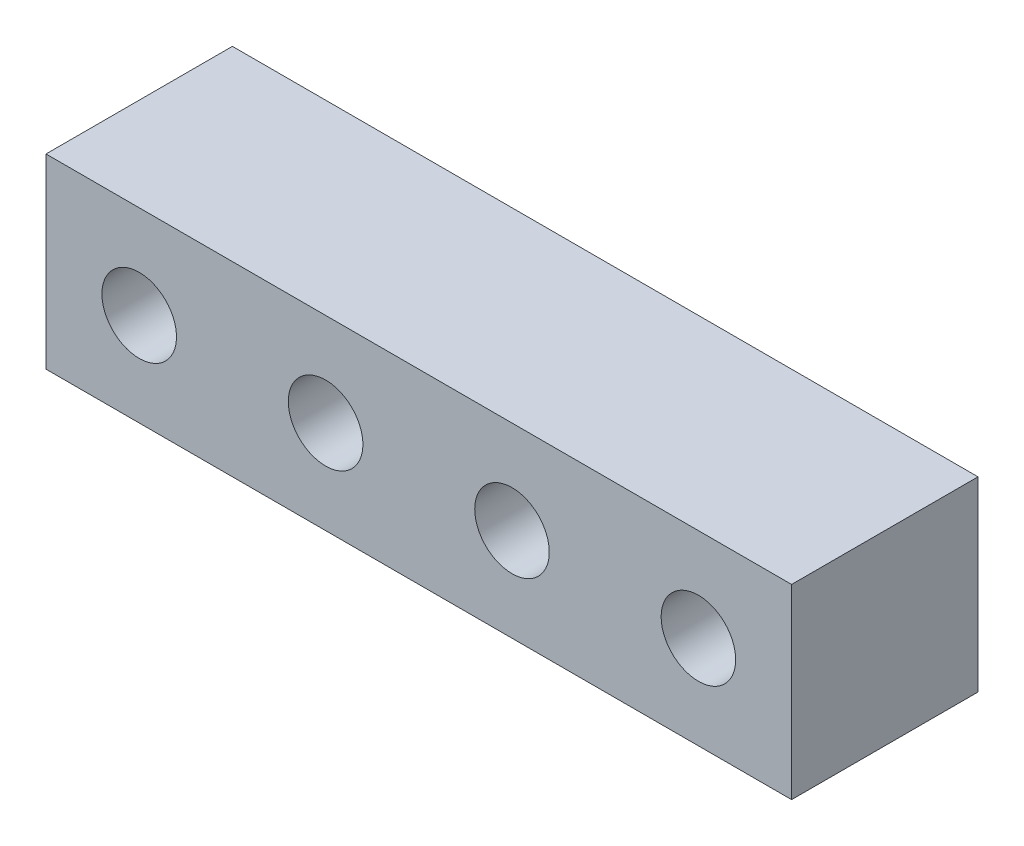
ISO-10303-21;
HEADER;
FILE_DESCRIPTION(('STEP AP214'),'2;1');
FILE_NAME('part.step','',(''),(''),'','','');
FILE_SCHEMA(('AUTOMOTIVE_DESIGN { 1 0 10303 214 1 1 1 1 }'));
ENDSEC;
DATA;
#1=APPLICATION_CONTEXT('core data for automotive mechanical design processes');
#2=APPLICATION_PROTOCOL_DEFINITION('international standard','automotive_design',2000,#1);
#3=PRODUCT_CONTEXT('',#1,'mechanical');
#4=PRODUCT('Part','Part','',(#3));
#5=PRODUCT_RELATED_PRODUCT_CATEGORY('part','',(#4));
#6=PRODUCT_DEFINITION_FORMATION('','',#4);
#7=PRODUCT_DEFINITION_CONTEXT('part definition',#1,'design');
#8=PRODUCT_DEFINITION('design','',#6,#7);
#9=PRODUCT_DEFINITION_SHAPE('','',#8);
#10=(LENGTH_UNIT() NAMED_UNIT(*) SI_UNIT(.MILLI.,.METRE.));
#11=(NAMED_UNIT(*) PLANE_ANGLE_UNIT() SI_UNIT($,.RADIAN.));
#12=(NAMED_UNIT(*) SI_UNIT($,.STERADIAN.) SOLID_ANGLE_UNIT());
#13=UNCERTAINTY_MEASURE_WITH_UNIT(LENGTH_MEASURE(1.E-05),#10,'distance_accuracy_value','');
#14=(GEOMETRIC_REPRESENTATION_CONTEXT(3) GLOBAL_UNCERTAINTY_ASSIGNED_CONTEXT((#13)) GLOBAL_UNIT_ASSIGNED_CONTEXT((#10,
#11,#12)) REPRESENTATION_CONTEXT('',''));
#15=CARTESIAN_POINT('',(0.,0.,0.));
#16=DIRECTION('',(0.,0.,1.));
#17=DIRECTION('',(1.,0.,0.));
#18=AXIS2_PLACEMENT_3D('',#15,#16,#17);
#19=CARTESIAN_POINT('',(-3.81,12.25,0.));
#20=DIRECTION('',(0.,0.,-1.));
#21=DIRECTION('',(1.,0.,0.));
#22=AXIS2_PLACEMENT_3D('',#19,#20,#21);
#23=CYLINDRICAL_SURFACE('',#22,0.508);
#24=CARTESIAN_POINT('',(-3.81,12.25,-2.54));
#25=DIRECTION('',(0.,0.,1.));
#26=DIRECTION('',(1.,0.,0.));
#27=AXIS2_PLACEMENT_3D('',#24,#25,#26);
#28=CIRCLE('',#27,0.508);
#29=CARTESIAN_POINT('',(-4.318,12.25,-2.54));
#30=VERTEX_POINT('',#29);
#31=EDGE_CURVE('E39',#30,#30,#28,.T.);
#32=ORIENTED_EDGE('',*,*,#31,.F.);
#33=EDGE_LOOP('',(#32));
#34=FACE_BOUND('',#33,.T.);
#35=CARTESIAN_POINT('',(-3.81,12.25,0.));
#36=DIRECTION('',(0.,0.,1.));
#37=DIRECTION('',(1.,0.,0.));
#38=AXIS2_PLACEMENT_3D('',#35,#36,#37);
#39=CIRCLE('',#38,0.508);
#40=CARTESIAN_POINT('',(-4.318,12.25,0.));
#41=VERTEX_POINT('',#40);
#42=EDGE_CURVE('E11',#41,#41,#39,.T.);
#43=ORIENTED_EDGE('',*,*,#42,.T.);
#44=EDGE_LOOP('',(#43));
#45=FACE_BOUND('',#44,.T.);
#46=ADVANCED_FACE('F16',(#34,#45),#23,.F.);
#47=CARTESIAN_POINT('',(1.27,12.25,0.));
#48=DIRECTION('',(0.,0.,-1.));
#49=DIRECTION('',(1.,0.,0.));
#50=AXIS2_PLACEMENT_3D('',#47,#48,#49);
#51=CYLINDRICAL_SURFACE('',#50,0.508);
#52=CARTESIAN_POINT('',(1.27,12.25,-2.54));
#53=DIRECTION('',(0.,0.,1.));
#54=DIRECTION('',(1.,0.,0.));
#55=AXIS2_PLACEMENT_3D('',#52,#53,#54);
#56=CIRCLE('',#55,0.508);
#57=CARTESIAN_POINT('',(0.762,12.25,-2.54));
#58=VERTEX_POINT('',#57);
#59=EDGE_CURVE('E131',#58,#58,#56,.T.);
#60=ORIENTED_EDGE('',*,*,#59,.F.);
#61=EDGE_LOOP('',(#60));
#62=FACE_BOUND('',#61,.T.);
#63=CARTESIAN_POINT('',(1.27,12.25,0.));
#64=DIRECTION('',(0.,0.,1.));
#65=DIRECTION('',(1.,0.,0.));
#66=AXIS2_PLACEMENT_3D('',#63,#64,#65);
#67=CIRCLE('',#66,0.508);
#68=CARTESIAN_POINT('',(0.762,12.25,0.));
#69=VERTEX_POINT('',#68);
#70=EDGE_CURVE('E27',#69,#69,#67,.T.);
#71=ORIENTED_EDGE('',*,*,#70,.T.);
#72=EDGE_LOOP('',(#71));
#73=FACE_BOUND('',#72,.T.);
#74=ADVANCED_FACE('F273',(#62,#73),#51,.F.);
#75=CARTESIAN_POINT('',(3.81,12.25,0.));
#76=DIRECTION('',(0.,0.,-1.));
#77=DIRECTION('',(1.,0.,0.));
#78=AXIS2_PLACEMENT_3D('',#75,#76,#77);
#79=CYLINDRICAL_SURFACE('',#78,0.508);
#80=CARTESIAN_POINT('',(3.81,12.25,-2.54));
#81=DIRECTION('',(0.,0.,1.));
#82=DIRECTION('',(1.,0.,0.));
#83=AXIS2_PLACEMENT_3D('',#80,#81,#82);
#84=CIRCLE('',#83,0.508);
#85=CARTESIAN_POINT('',(3.302,12.25,-2.54));
#86=VERTEX_POINT('',#85);
#87=EDGE_CURVE('E137',#86,#86,#84,.T.);
#88=ORIENTED_EDGE('',*,*,#87,.F.);
#89=EDGE_LOOP('',(#88));
#90=FACE_BOUND('',#89,.T.);
#91=CARTESIAN_POINT('',(3.81,12.25,0.));
#92=DIRECTION('',(0.,0.,1.));
#93=DIRECTION('',(1.,0.,0.));
#94=AXIS2_PLACEMENT_3D('',#91,#92,#93);
#95=CIRCLE('',#94,0.508);
#96=CARTESIAN_POINT('',(3.302,12.25,0.));
#97=VERTEX_POINT('',#96);
#98=EDGE_CURVE('E141',#97,#97,#95,.T.);
#99=ORIENTED_EDGE('',*,*,#98,.T.);
#100=EDGE_LOOP('',(#99));
#101=FACE_BOUND('',#100,.T.);
#102=ADVANCED_FACE('F250',(#90,#101),#79,.F.);
#103=CARTESIAN_POINT('',(-1.27,12.25,0.));
#104=DIRECTION('',(0.,0.,-1.));
#105=DIRECTION('',(1.,0.,0.));
#106=AXIS2_PLACEMENT_3D('',#103,#104,#105);
#107=CYLINDRICAL_SURFACE('',#106,0.508);
#108=CARTESIAN_POINT('',(-1.27,12.25,-2.54));
#109=DIRECTION('',(0.,0.,1.));
#110=DIRECTION('',(1.,0.,0.));
#111=AXIS2_PLACEMENT_3D('',#108,#109,#110);
#112=CIRCLE('',#111,0.508);
#113=CARTESIAN_POINT('',(-1.778,12.25,-2.54));
#114=VERTEX_POINT('',#113);
#115=EDGE_CURVE('E133',#114,#114,#112,.T.);
#116=ORIENTED_EDGE('',*,*,#115,.F.);
#117=EDGE_LOOP('',(#116));
#118=FACE_BOUND('',#117,.T.);
#119=CARTESIAN_POINT('',(-1.27,12.25,0.));
#120=DIRECTION('',(0.,0.,1.));
#121=DIRECTION('',(1.,0.,0.));
#122=AXIS2_PLACEMENT_3D('',#119,#120,#121);
#123=CIRCLE('',#122,0.508);
#124=CARTESIAN_POINT('',(-1.778,12.25,0.));
#125=VERTEX_POINT('',#124);
#126=EDGE_CURVE('E160',#125,#125,#123,.T.);
#127=ORIENTED_EDGE('',*,*,#126,.T.);
#128=EDGE_LOOP('',(#127));
#129=FACE_BOUND('',#128,.T.);
#130=ADVANCED_FACE('F245',(#118,#129),#107,.F.);
#131=CARTESIAN_POINT('',(-5.08,10.98,0.));
#132=DIRECTION('',(-1.,0.,0.));
#133=DIRECTION('',(0.,0.,1.));
#134=AXIS2_PLACEMENT_3D('',#131,#132,#133);
#135=PLANE('',#134);
#136=DIRECTION('',(0.,-1.,0.));
#137=VECTOR('',#136,1.);
#138=CARTESIAN_POINT('',(-5.08,13.52,0.));
#139=LINE('',#138,#137);
#140=CARTESIAN_POINT('',(-5.08,13.52,0.));
#141=VERTEX_POINT('',#140);
#142=CARTESIAN_POINT('',(-5.08,10.98,0.));
#143=VERTEX_POINT('',#142);
#144=EDGE_CURVE('E148',#141,#143,#139,.T.);
#145=ORIENTED_EDGE('',*,*,#144,.F.);
#146=DIRECTION('',(0.,0.,-1.));
#147=VECTOR('',#146,1.);
#148=CARTESIAN_POINT('',(-5.08,13.52,0.));
#149=LINE('',#148,#147);
#150=CARTESIAN_POINT('',(-5.08,13.52,-2.54));
#151=VERTEX_POINT('',#150);
#152=EDGE_CURVE('E144',#141,#151,#149,.T.);
#153=ORIENTED_EDGE('',*,*,#152,.T.);
#154=DIRECTION('',(0.,1.,0.));
#155=VECTOR('',#154,1.);
#156=CARTESIAN_POINT('',(-5.08,13.52,-2.54));
#157=LINE('',#156,#155);
#158=CARTESIAN_POINT('',(-5.08,10.98,-2.54));
#159=VERTEX_POINT('',#158);
#160=EDGE_CURVE('E107',#159,#151,#157,.T.);
#161=ORIENTED_EDGE('',*,*,#160,.F.);
#162=DIRECTION('',(0.,0.,-1.));
#163=VECTOR('',#162,1.);
#164=CARTESIAN_POINT('',(-5.08,10.98,0.));
#165=LINE('',#164,#163);
#166=EDGE_CURVE('E101',#143,#159,#165,.T.);
#167=ORIENTED_EDGE('',*,*,#166,.F.);
#168=EDGE_LOOP('',(#145,#153,#161,#167));
#169=FACE_BOUND('',#168,.T.);
#170=ADVANCED_FACE('F182',(#169),#135,.T.);
#171=CARTESIAN_POINT('',(5.08,10.98,0.));
#172=DIRECTION('',(0.,-1.,0.));
#173=DIRECTION('',(0.,0.,-1.));
#174=AXIS2_PLACEMENT_3D('',#171,#172,#173);
#175=PLANE('',#174);
#176=DIRECTION('',(1.,0.,0.));
#177=VECTOR('',#176,1.);
#178=CARTESIAN_POINT('',(-5.08,10.98,0.));
#179=LINE('',#178,#177);
#180=CARTESIAN_POINT('',(5.08,10.98,0.));
#181=VERTEX_POINT('',#180);
#182=EDGE_CURVE('E145',#143,#181,#179,.T.);
#183=ORIENTED_EDGE('',*,*,#182,.F.);
#184=ORIENTED_EDGE('',*,*,#166,.T.);
#185=DIRECTION('',(-1.,0.,0.));
#186=VECTOR('',#185,1.);
#187=CARTESIAN_POINT('',(-5.08,10.98,-2.54));
#188=LINE('',#187,#186);
#189=CARTESIAN_POINT('',(5.08,10.98,-2.54));
#190=VERTEX_POINT('',#189);
#191=EDGE_CURVE('E20',#190,#159,#188,.T.);
#192=ORIENTED_EDGE('',*,*,#191,.F.);
#193=DIRECTION('',(0.,0.,-1.));
#194=VECTOR('',#193,1.);
#195=CARTESIAN_POINT('',(5.08,10.98,0.));
#196=LINE('',#195,#194);
#197=EDGE_CURVE('E98',#181,#190,#196,.T.);
#198=ORIENTED_EDGE('',*,*,#197,.F.);
#199=EDGE_LOOP('',(#183,#184,#192,#198));
#200=FACE_BOUND('',#199,.T.);
#201=ADVANCED_FACE('F97',(#200),#175,.T.);
#202=CARTESIAN_POINT('',(5.08,13.52,0.));
#203=DIRECTION('',(1.,0.,0.));
#204=DIRECTION('',(0.,1.,0.));
#205=AXIS2_PLACEMENT_3D('',#202,#203,#204);
#206=PLANE('',#205);
#207=DIRECTION('',(0.,1.,0.));
#208=VECTOR('',#207,1.);
#209=CARTESIAN_POINT('',(5.08,10.98,0.));
#210=LINE('',#209,#208);
#211=CARTESIAN_POINT('',(5.08,13.52,0.));
#212=VERTEX_POINT('',#211);
#213=EDGE_CURVE('E112',#181,#212,#210,.T.);
#214=ORIENTED_EDGE('',*,*,#213,.F.);
#215=ORIENTED_EDGE('',*,*,#197,.T.);
#216=DIRECTION('',(0.,-1.,0.));
#217=VECTOR('',#216,1.);
#218=CARTESIAN_POINT('',(5.08,10.98,-2.54));
#219=LINE('',#218,#217);
#220=CARTESIAN_POINT('',(5.08,13.52,-2.54));
#221=VERTEX_POINT('',#220);
#222=EDGE_CURVE('E106',#221,#190,#219,.T.);
#223=ORIENTED_EDGE('',*,*,#222,.F.);
#224=DIRECTION('',(0.,0.,-1.));
#225=VECTOR('',#224,1.);
#226=CARTESIAN_POINT('',(5.08,13.52,0.));
#227=LINE('',#226,#225);
#228=EDGE_CURVE('E114',#212,#221,#227,.T.);
#229=ORIENTED_EDGE('',*,*,#228,.F.);
#230=EDGE_LOOP('',(#214,#215,#223,#229));
#231=FACE_BOUND('',#230,.T.);
#232=ADVANCED_FACE('F18',(#231),#206,.T.);
#233=CARTESIAN_POINT('',(-5.08,13.52,0.));
#234=DIRECTION('',(0.,1.,0.));
#235=DIRECTION('',(1.,0.,0.));
#236=AXIS2_PLACEMENT_3D('',#233,#234,#235);
#237=PLANE('',#236);
#238=DIRECTION('',(-1.,0.,0.));
#239=VECTOR('',#238,1.);
#240=CARTESIAN_POINT('',(5.08,13.52,0.));
#241=LINE('',#240,#239);
#242=EDGE_CURVE('E132',#212,#141,#241,.T.);
#243=ORIENTED_EDGE('',*,*,#242,.F.);
#244=ORIENTED_EDGE('',*,*,#228,.T.);
#245=DIRECTION('',(1.,0.,0.));
#246=VECTOR('',#245,1.);
#247=CARTESIAN_POINT('',(5.08,13.52,-2.54));
#248=LINE('',#247,#246);
#249=EDGE_CURVE('E120',#151,#221,#248,.T.);
#250=ORIENTED_EDGE('',*,*,#249,.F.);
#251=ORIENTED_EDGE('',*,*,#152,.F.);
#252=EDGE_LOOP('',(#243,#244,#250,#251));
#253=FACE_BOUND('',#252,.T.);
#254=ADVANCED_FACE('F231',(#253),#237,.T.);
#255=CARTESIAN_POINT('',(0.,12.25,-2.54));
#256=DIRECTION('',(0.,0.,-1.));
#257=DIRECTION('',(0.,-1.,0.));
#258=AXIS2_PLACEMENT_3D('',#255,#256,#257);
#259=PLANE('',#258);
#260=ORIENTED_EDGE('',*,*,#249,.T.);
#261=ORIENTED_EDGE('',*,*,#222,.T.);
#262=ORIENTED_EDGE('',*,*,#191,.T.);
#263=ORIENTED_EDGE('',*,*,#160,.T.);
#264=EDGE_LOOP('',(#260,#261,#262,#263));
#265=FACE_BOUND('',#264,.T.);
#266=ORIENTED_EDGE('',*,*,#115,.T.);
#267=EDGE_LOOP('',(#266));
#268=FACE_BOUND('',#267,.T.);
#269=ORIENTED_EDGE('',*,*,#87,.T.);
#270=EDGE_LOOP('',(#269));
#271=FACE_BOUND('',#270,.T.);
#272=ORIENTED_EDGE('',*,*,#59,.T.);
#273=EDGE_LOOP('',(#272));
#274=FACE_BOUND('',#273,.T.);
#275=ORIENTED_EDGE('',*,*,#31,.T.);
#276=EDGE_LOOP('',(#275));
#277=FACE_BOUND('',#276,.T.);
#278=ADVANCED_FACE('F117',(#265,#268,#271,#274,#277),#259,.T.);
#279=CARTESIAN_POINT('',(0.,12.25,0.));
#280=DIRECTION('',(0.,0.,-1.));
#281=DIRECTION('',(0.,-1.,0.));
#282=AXIS2_PLACEMENT_3D('',#279,#280,#281);
#283=PLANE('',#282);
#284=ORIENTED_EDGE('',*,*,#242,.T.);
#285=ORIENTED_EDGE('',*,*,#144,.T.);
#286=ORIENTED_EDGE('',*,*,#182,.T.);
#287=ORIENTED_EDGE('',*,*,#213,.T.);
#288=EDGE_LOOP('',(#284,#285,#286,#287));
#289=FACE_BOUND('',#288,.T.);
#290=ORIENTED_EDGE('',*,*,#126,.F.);
#291=EDGE_LOOP('',(#290));
#292=FACE_BOUND('',#291,.T.);
#293=ORIENTED_EDGE('',*,*,#98,.F.);
#294=EDGE_LOOP('',(#293));
#295=FACE_BOUND('',#294,.T.);
#296=ORIENTED_EDGE('',*,*,#70,.F.);
#297=EDGE_LOOP('',(#296));
#298=FACE_BOUND('',#297,.T.);
#299=ORIENTED_EDGE('',*,*,#42,.F.);
#300=EDGE_LOOP('',(#299));
#301=FACE_BOUND('',#300,.T.);
#302=ADVANCED_FACE('F177',(#289,#292,#295,#298,#301),#283,.F.);
#303=CLOSED_SHELL('',(#46,#74,#102,#130,#170,#201,#232,#254,#278,#302));
#304=MANIFOLD_SOLID_BREP('B1',#303);
#305=ADVANCED_BREP_SHAPE_REPRESENTATION('',(#18,#304),#14);
#306=SHAPE_DEFINITION_REPRESENTATION(#9,#305);
ENDSEC;
END-ISO-10303-21;
